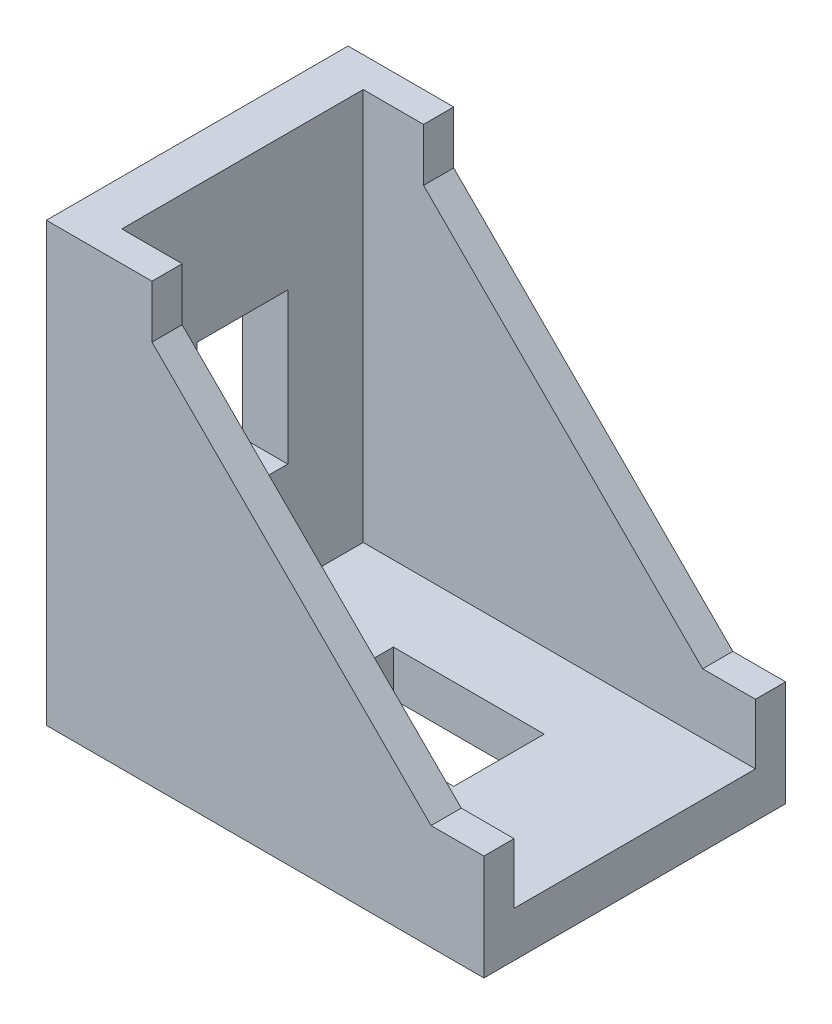
ISO-10303-21;
HEADER;
FILE_DESCRIPTION(('STEP AP214'),'2;1');
FILE_NAME('part.step','',(''),(''),'','','');
FILE_SCHEMA(('AUTOMOTIVE_DESIGN { 1 0 10303 214 1 1 1 1 }'));
ENDSEC;
DATA;
#1=APPLICATION_CONTEXT('core data for automotive mechanical design processes');
#2=APPLICATION_PROTOCOL_DEFINITION('international standard','automotive_design',2000,#1);
#3=PRODUCT_CONTEXT('',#1,'mechanical');
#4=PRODUCT('Part','Part','',(#3));
#5=PRODUCT_RELATED_PRODUCT_CATEGORY('part','',(#4));
#6=PRODUCT_DEFINITION_FORMATION('','',#4);
#7=PRODUCT_DEFINITION_CONTEXT('part definition',#1,'design');
#8=PRODUCT_DEFINITION('design','',#6,#7);
#9=PRODUCT_DEFINITION_SHAPE('','',#8);
#10=(LENGTH_UNIT() NAMED_UNIT(*) SI_UNIT(.MILLI.,.METRE.));
#11=(NAMED_UNIT(*) PLANE_ANGLE_UNIT() SI_UNIT($,.RADIAN.));
#12=(NAMED_UNIT(*) SI_UNIT($,.STERADIAN.) SOLID_ANGLE_UNIT());
#13=UNCERTAINTY_MEASURE_WITH_UNIT(LENGTH_MEASURE(1.E-05),#10,'distance_accuracy_value','');
#14=(GEOMETRIC_REPRESENTATION_CONTEXT(3) GLOBAL_UNCERTAINTY_ASSIGNED_CONTEXT((#13)) GLOBAL_UNIT_ASSIGNED_CONTEXT((#10,
#11,#12)) REPRESENTATION_CONTEXT('',''));
#15=CARTESIAN_POINT('',(0.,0.,0.));
#16=DIRECTION('',(0.,0.,1.));
#17=DIRECTION('',(1.,0.,0.));
#18=AXIS2_PLACEMENT_3D('',#15,#16,#17);
#19=CARTESIAN_POINT('',(14.5,-14.5,20.));
#20=DIRECTION('',(-1.,0.,0.));
#21=DIRECTION('',(0.,0.,1.));
#22=AXIS2_PLACEMENT_3D('',#19,#20,#21);
#23=PLANE('',#22);
#24=DIRECTION('',(0.,1.,0.));
#25=VECTOR('',#24,1.);
#26=CARTESIAN_POINT('',(14.5,-14.5,0.));
#27=LINE('',#26,#25);
#28=CARTESIAN_POINT('',(14.5,-14.5,0.));
#29=VERTEX_POINT('',#28);
#30=CARTESIAN_POINT('',(14.5,-7.5,0.));
#31=VERTEX_POINT('',#30);
#32=EDGE_CURVE('E298',#29,#31,#27,.T.);
#33=ORIENTED_EDGE('',*,*,#32,.T.);
#34=DIRECTION('',(0.,0.,1.));
#35=VECTOR('',#34,1.);
#36=CARTESIAN_POINT('',(14.5,-7.5,0.));
#37=LINE('',#36,#35);
#38=CARTESIAN_POINT('',(14.5,-7.5,2.));
#39=VERTEX_POINT('',#38);
#40=EDGE_CURVE('E251',#31,#39,#37,.T.);
#41=ORIENTED_EDGE('',*,*,#40,.T.);
#42=DIRECTION('',(0.,1.,0.));
#43=VECTOR('',#42,1.);
#44=CARTESIAN_POINT('',(14.5,-11.5,2.));
#45=LINE('',#44,#43);
#46=CARTESIAN_POINT('',(14.5,-11.5,2.));
#47=VERTEX_POINT('',#46);
#48=EDGE_CURVE('E288',#47,#39,#45,.T.);
#49=ORIENTED_EDGE('',*,*,#48,.F.);
#50=DIRECTION('',(0.,0.,-1.));
#51=VECTOR('',#50,1.);
#52=CARTESIAN_POINT('',(14.5,-11.5,18.));
#53=LINE('',#52,#51);
#54=CARTESIAN_POINT('',(14.5,-11.5,18.));
#55=VERTEX_POINT('',#54);
#56=EDGE_CURVE('E275',#55,#47,#53,.T.);
#57=ORIENTED_EDGE('',*,*,#56,.F.);
#58=DIRECTION('',(0.,1.,0.));
#59=VECTOR('',#58,1.);
#60=CARTESIAN_POINT('',(14.5,-11.5,18.));
#61=LINE('',#60,#59);
#62=CARTESIAN_POINT('',(14.5,-7.5,18.));
#63=VERTEX_POINT('',#62);
#64=EDGE_CURVE('E295',#55,#63,#61,.T.);
#65=ORIENTED_EDGE('',*,*,#64,.T.);
#66=CARTESIAN_POINT('',(14.5,-7.5,20.));
#67=VERTEX_POINT('',#66);
#68=EDGE_CURVE('E255',#63,#67,#37,.T.);
#69=ORIENTED_EDGE('',*,*,#68,.T.);
#70=DIRECTION('',(0.,1.,0.));
#71=VECTOR('',#70,1.);
#72=CARTESIAN_POINT('',(14.5,-14.5,20.));
#73=LINE('',#72,#71);
#74=CARTESIAN_POINT('',(14.5,-14.5,20.));
#75=VERTEX_POINT('',#74);
#76=EDGE_CURVE('E306',#75,#67,#73,.T.);
#77=ORIENTED_EDGE('',*,*,#76,.F.);
#78=DIRECTION('',(0.,0.,-1.));
#79=VECTOR('',#78,1.);
#80=CARTESIAN_POINT('',(14.5,-14.5,20.));
#81=LINE('',#80,#79);
#82=EDGE_CURVE('E316',#75,#29,#81,.T.);
#83=ORIENTED_EDGE('',*,*,#82,.T.);
#84=EDGE_LOOP('',(#33,#41,#49,#57,#65,#69,#77,#83));
#85=FACE_BOUND('',#84,.T.);
#86=ADVANCED_FACE('F37',(#85),#23,.F.);
#87=CARTESIAN_POINT('',(-14.5,14.5,20.));
#88=DIRECTION('',(0.,-1.,0.));
#89=DIRECTION('',(0.,0.,-1.));
#90=AXIS2_PLACEMENT_3D('',#87,#88,#89);
#91=PLANE('',#90);
#92=DIRECTION('',(-1.,0.,0.));
#93=VECTOR('',#92,1.);
#94=CARTESIAN_POINT('',(-14.5,14.5,20.));
#95=LINE('',#94,#93);
#96=CARTESIAN_POINT('',(-7.5,14.5,20.));
#97=VERTEX_POINT('',#96);
#98=CARTESIAN_POINT('',(-14.5,14.5,20.));
#99=VERTEX_POINT('',#98);
#100=EDGE_CURVE('E309',#97,#99,#95,.T.);
#101=ORIENTED_EDGE('',*,*,#100,.F.);
#102=DIRECTION('',(0.,0.,1.));
#103=VECTOR('',#102,1.);
#104=CARTESIAN_POINT('',(-7.5,14.5,0.));
#105=LINE('',#104,#103);
#106=CARTESIAN_POINT('',(-7.5,14.5,18.));
#107=VERTEX_POINT('',#106);
#108=EDGE_CURVE('E244',#107,#97,#105,.T.);
#109=ORIENTED_EDGE('',*,*,#108,.F.);
#110=DIRECTION('',(1.,0.,0.));
#111=VECTOR('',#110,1.);
#112=CARTESIAN_POINT('',(-11.5,14.5,18.));
#113=LINE('',#112,#111);
#114=CARTESIAN_POINT('',(-11.5,14.5,18.));
#115=VERTEX_POINT('',#114);
#116=EDGE_CURVE('E279',#115,#107,#113,.T.);
#117=ORIENTED_EDGE('',*,*,#116,.F.);
#118=DIRECTION('',(0.,0.,1.));
#119=VECTOR('',#118,1.);
#120=CARTESIAN_POINT('',(-11.5,14.5,18.));
#121=LINE('',#120,#119);
#122=CARTESIAN_POINT('',(-11.5,14.5,2.));
#123=VERTEX_POINT('',#122);
#124=EDGE_CURVE('E290',#123,#115,#121,.T.);
#125=ORIENTED_EDGE('',*,*,#124,.F.);
#126=DIRECTION('',(-1.,0.,0.));
#127=VECTOR('',#126,1.);
#128=CARTESIAN_POINT('',(-11.5,14.5,2.));
#129=LINE('',#128,#127);
#130=CARTESIAN_POINT('',(-7.5,14.5,2.));
#131=VERTEX_POINT('',#130);
#132=EDGE_CURVE('E274',#131,#123,#129,.T.);
#133=ORIENTED_EDGE('',*,*,#132,.F.);
#134=CARTESIAN_POINT('',(-7.5,14.5,0.));
#135=VERTEX_POINT('',#134);
#136=EDGE_CURVE('E264',#135,#131,#105,.T.);
#137=ORIENTED_EDGE('',*,*,#136,.F.);
#138=DIRECTION('',(-1.,0.,0.));
#139=VECTOR('',#138,1.);
#140=CARTESIAN_POINT('',(-14.5,14.5,0.));
#141=LINE('',#140,#139);
#142=CARTESIAN_POINT('',(-14.5,14.5,0.));
#143=VERTEX_POINT('',#142);
#144=EDGE_CURVE('E319',#135,#143,#141,.T.);
#145=ORIENTED_EDGE('',*,*,#144,.T.);
#146=DIRECTION('',(0.,0.,-1.));
#147=VECTOR('',#146,1.);
#148=CARTESIAN_POINT('',(-14.5,14.5,20.));
#149=LINE('',#148,#147);
#150=EDGE_CURVE('E329',#99,#143,#149,.T.);
#151=ORIENTED_EDGE('',*,*,#150,.F.);
#152=EDGE_LOOP('',(#101,#109,#117,#125,#133,#137,#145,#151));
#153=FACE_BOUND('',#152,.T.);
#154=ADVANCED_FACE('F377',(#153),#91,.F.);
#155=CARTESIAN_POINT('',(-14.5,-14.5,20.));
#156=DIRECTION('',(1.,0.,0.));
#157=DIRECTION('',(0.,0.,-1.));
#158=AXIS2_PLACEMENT_3D('',#155,#156,#157);
#159=PLANE('',#158);
#160=DIRECTION('',(0.,0.,-1.));
#161=VECTOR('',#160,1.);
#162=CARTESIAN_POINT('',(-14.5,5.50000000000001,7.));
#163=LINE('',#162,#161);
#164=CARTESIAN_POINT('',(-14.5,5.50000000000001,13.));
#165=VERTEX_POINT('',#164);
#166=CARTESIAN_POINT('',(-14.5,5.50000000000001,7.));
#167=VERTEX_POINT('',#166);
#168=EDGE_CURVE('E197',#165,#167,#163,.T.);
#169=ORIENTED_EDGE('',*,*,#168,.F.);
#170=DIRECTION('',(0.,1.,0.));
#171=VECTOR('',#170,1.);
#172=CARTESIAN_POINT('',(-14.5,5.50000000000001,13.));
#173=LINE('',#172,#171);
#174=CARTESIAN_POINT('',(-14.5,-4.49999999999999,13.));
#175=VERTEX_POINT('',#174);
#176=EDGE_CURVE('E51',#175,#165,#173,.T.);
#177=ORIENTED_EDGE('',*,*,#176,.F.);
#178=DIRECTION('',(0.,0.,1.));
#179=VECTOR('',#178,1.);
#180=CARTESIAN_POINT('',(-14.5,-4.49999999999999,7.));
#181=LINE('',#180,#179);
#182=CARTESIAN_POINT('',(-14.5,-4.49999999999999,7.));
#183=VERTEX_POINT('',#182);
#184=EDGE_CURVE('E204',#183,#175,#181,.T.);
#185=ORIENTED_EDGE('',*,*,#184,.F.);
#186=DIRECTION('',(0.,-1.,0.));
#187=VECTOR('',#186,1.);
#188=CARTESIAN_POINT('',(-14.5,5.50000000000001,7.));
#189=LINE('',#188,#187);
#190=EDGE_CURVE('E188',#167,#183,#189,.T.);
#191=ORIENTED_EDGE('',*,*,#190,.F.);
#192=EDGE_LOOP('',(#169,#177,#185,#191));
#193=FACE_BOUND('',#192,.T.);
#194=DIRECTION('',(0.,-1.,0.));
#195=VECTOR('',#194,1.);
#196=CARTESIAN_POINT('',(-14.5,-14.5,0.));
#197=LINE('',#196,#195);
#198=CARTESIAN_POINT('',(-14.5,-14.5,0.));
#199=VERTEX_POINT('',#198);
#200=EDGE_CURVE('E321',#143,#199,#197,.T.);
#201=ORIENTED_EDGE('',*,*,#200,.T.);
#202=DIRECTION('',(0.,0.,-1.));
#203=VECTOR('',#202,1.);
#204=CARTESIAN_POINT('',(-14.5,-14.5,20.));
#205=LINE('',#204,#203);
#206=CARTESIAN_POINT('',(-14.5,-14.5,20.));
#207=VERTEX_POINT('',#206);
#208=EDGE_CURVE('E326',#207,#199,#205,.T.);
#209=ORIENTED_EDGE('',*,*,#208,.F.);
#210=DIRECTION('',(0.,-1.,0.));
#211=VECTOR('',#210,1.);
#212=CARTESIAN_POINT('',(-14.5,-14.5,20.));
#213=LINE('',#212,#211);
#214=EDGE_CURVE('E312',#99,#207,#213,.T.);
#215=ORIENTED_EDGE('',*,*,#214,.F.);
#216=ORIENTED_EDGE('',*,*,#150,.T.);
#217=EDGE_LOOP('',(#201,#209,#215,#216));
#218=FACE_BOUND('',#217,.T.);
#219=ADVANCED_FACE('F201',(#193,#218),#159,.F.);
#220=CARTESIAN_POINT('',(-14.5,-14.5,20.));
#221=DIRECTION('',(0.,1.,0.));
#222=DIRECTION('',(0.,0.,1.));
#223=AXIS2_PLACEMENT_3D('',#220,#221,#222);
#224=PLANE('',#223);
#225=DIRECTION('',(-1.,0.,0.));
#226=VECTOR('',#225,1.);
#227=CARTESIAN_POINT('',(-4.5,-14.5,13.));
#228=LINE('',#227,#226);
#229=CARTESIAN_POINT('',(5.5,-14.5,13.));
#230=VERTEX_POINT('',#229);
#231=CARTESIAN_POINT('',(-4.5,-14.5,13.));
#232=VERTEX_POINT('',#231);
#233=EDGE_CURVE('E215',#230,#232,#228,.T.);
#234=ORIENTED_EDGE('',*,*,#233,.F.);
#235=DIRECTION('',(0.,0.,1.));
#236=VECTOR('',#235,1.);
#237=CARTESIAN_POINT('',(5.5,-14.5,13.));
#238=LINE('',#237,#236);
#239=CARTESIAN_POINT('',(5.5,-14.5,7.));
#240=VERTEX_POINT('',#239);
#241=EDGE_CURVE('E211',#240,#230,#238,.T.);
#242=ORIENTED_EDGE('',*,*,#241,.F.);
#243=DIRECTION('',(1.,0.,0.));
#244=VECTOR('',#243,1.);
#245=CARTESIAN_POINT('',(-4.5,-14.5,7.));
#246=LINE('',#245,#244);
#247=CARTESIAN_POINT('',(-4.5,-14.5,7.));
#248=VERTEX_POINT('',#247);
#249=EDGE_CURVE('E221',#248,#240,#246,.T.);
#250=ORIENTED_EDGE('',*,*,#249,.F.);
#251=DIRECTION('',(0.,0.,-1.));
#252=VECTOR('',#251,1.);
#253=CARTESIAN_POINT('',(-4.5,-14.5,13.));
#254=LINE('',#253,#252);
#255=EDGE_CURVE('E218',#232,#248,#254,.T.);
#256=ORIENTED_EDGE('',*,*,#255,.F.);
#257=EDGE_LOOP('',(#234,#242,#250,#256));
#258=FACE_BOUND('',#257,.T.);
#259=DIRECTION('',(1.,0.,0.));
#260=VECTOR('',#259,1.);
#261=CARTESIAN_POINT('',(-14.5,-14.5,0.));
#262=LINE('',#261,#260);
#263=EDGE_CURVE('E310',#199,#29,#262,.T.);
#264=ORIENTED_EDGE('',*,*,#263,.T.);
#265=ORIENTED_EDGE('',*,*,#82,.F.);
#266=DIRECTION('',(1.,0.,0.));
#267=VECTOR('',#266,1.);
#268=CARTESIAN_POINT('',(-14.5,-14.5,20.));
#269=LINE('',#268,#267);
#270=EDGE_CURVE('E314',#207,#75,#269,.T.);
#271=ORIENTED_EDGE('',*,*,#270,.F.);
#272=ORIENTED_EDGE('',*,*,#208,.T.);
#273=EDGE_LOOP('',(#264,#265,#271,#272));
#274=FACE_BOUND('',#273,.T.);
#275=ADVANCED_FACE('F420',(#258,#274),#224,.F.);
#276=CARTESIAN_POINT('',(0.,0.,20.));
#277=DIRECTION('',(0.,0.,-1.));
#278=DIRECTION('',(-1.,0.,0.));
#279=AXIS2_PLACEMENT_3D('',#276,#277,#278);
#280=PLANE('',#279);
#281=ORIENTED_EDGE('',*,*,#76,.T.);
#282=DIRECTION('',(1.,0.,0.));
#283=VECTOR('',#282,1.);
#284=CARTESIAN_POINT('',(11.,-7.5,20.));
#285=LINE('',#284,#283);
#286=CARTESIAN_POINT('',(11.,-7.5,20.));
#287=VERTEX_POINT('',#286);
#288=EDGE_CURVE('E238',#287,#67,#285,.T.);
#289=ORIENTED_EDGE('',*,*,#288,.F.);
#290=DIRECTION('',(0.707106781186548,-0.707106781186548,0.));
#291=VECTOR('',#290,1.);
#292=CARTESIAN_POINT('',(-7.5,11.,20.));
#293=LINE('',#292,#291);
#294=CARTESIAN_POINT('',(-7.5,11.,20.));
#295=VERTEX_POINT('',#294);
#296=EDGE_CURVE('E247',#295,#287,#293,.T.);
#297=ORIENTED_EDGE('',*,*,#296,.F.);
#298=DIRECTION('',(0.,-1.,0.));
#299=VECTOR('',#298,1.);
#300=CARTESIAN_POINT('',(-7.5,14.5,20.));
#301=LINE('',#300,#299);
#302=EDGE_CURVE('E227',#97,#295,#301,.T.);
#303=ORIENTED_EDGE('',*,*,#302,.F.);
#304=ORIENTED_EDGE('',*,*,#100,.T.);
#305=ORIENTED_EDGE('',*,*,#214,.T.);
#306=ORIENTED_EDGE('',*,*,#270,.T.);
#307=EDGE_LOOP('',(#281,#289,#297,#303,#304,#305,#306));
#308=FACE_BOUND('',#307,.T.);
#309=ADVANCED_FACE('F415',(#308),#280,.F.);
#310=CARTESIAN_POINT('',(0.,0.,0.));
#311=DIRECTION('',(0.,0.,-1.));
#312=DIRECTION('',(-1.,0.,0.));
#313=AXIS2_PLACEMENT_3D('',#310,#311,#312);
#314=PLANE('',#313);
#315=DIRECTION('',(1.,0.,0.));
#316=VECTOR('',#315,1.);
#317=CARTESIAN_POINT('',(11.,-7.5,0.));
#318=LINE('',#317,#316);
#319=CARTESIAN_POINT('',(11.,-7.5,0.));
#320=VERTEX_POINT('',#319);
#321=EDGE_CURVE('E241',#320,#31,#318,.T.);
#322=ORIENTED_EDGE('',*,*,#321,.T.);
#323=ORIENTED_EDGE('',*,*,#32,.F.);
#324=ORIENTED_EDGE('',*,*,#263,.F.);
#325=ORIENTED_EDGE('',*,*,#200,.F.);
#326=ORIENTED_EDGE('',*,*,#144,.F.);
#327=DIRECTION('',(0.,-1.,0.));
#328=VECTOR('',#327,1.);
#329=CARTESIAN_POINT('',(-7.5,14.5,0.));
#330=LINE('',#329,#328);
#331=CARTESIAN_POINT('',(-7.5,11.,0.));
#332=VERTEX_POINT('',#331);
#333=EDGE_CURVE('E234',#135,#332,#330,.T.);
#334=ORIENTED_EDGE('',*,*,#333,.T.);
#335=DIRECTION('',(0.707106781186548,-0.707106781186548,0.));
#336=VECTOR('',#335,1.);
#337=CARTESIAN_POINT('',(-7.5,11.,0.));
#338=LINE('',#337,#336);
#339=EDGE_CURVE('E237',#332,#320,#338,.T.);
#340=ORIENTED_EDGE('',*,*,#339,.T.);
#341=EDGE_LOOP('',(#322,#323,#324,#325,#326,#334,#340));
#342=FACE_BOUND('',#341,.T.);
#343=ADVANCED_FACE('F389',(#342),#314,.T.);
#344=CARTESIAN_POINT('',(-11.5,-11.5,18.));
#345=DIRECTION('',(0.,0.,1.));
#346=DIRECTION('',(1.,0.,0.));
#347=AXIS2_PLACEMENT_3D('',#344,#345,#346);
#348=PLANE('',#347);
#349=DIRECTION('',(0.707106781186548,-0.707106781186548,0.));
#350=VECTOR('',#349,1.);
#351=CARTESIAN_POINT('',(1.75,1.75,18.));
#352=LINE('',#351,#350);
#353=CARTESIAN_POINT('',(-7.5,11.,18.));
#354=VERTEX_POINT('',#353);
#355=CARTESIAN_POINT('',(11.,-7.5,18.));
#356=VERTEX_POINT('',#355);
#357=EDGE_CURVE('E268',#354,#356,#352,.T.);
#358=ORIENTED_EDGE('',*,*,#357,.T.);
#359=DIRECTION('',(1.,0.,0.));
#360=VECTOR('',#359,1.);
#361=CARTESIAN_POINT('',(-11.5,-7.5,18.));
#362=LINE('',#361,#360);
#363=EDGE_CURVE('E271',#356,#63,#362,.T.);
#364=ORIENTED_EDGE('',*,*,#363,.T.);
#365=ORIENTED_EDGE('',*,*,#64,.F.);
#366=DIRECTION('',(1.,0.,0.));
#367=VECTOR('',#366,1.);
#368=CARTESIAN_POINT('',(-11.5,-11.5,18.));
#369=LINE('',#368,#367);
#370=CARTESIAN_POINT('',(-11.5,-11.5,18.));
#371=VERTEX_POINT('',#370);
#372=EDGE_CURVE('E285',#371,#55,#369,.T.);
#373=ORIENTED_EDGE('',*,*,#372,.F.);
#374=DIRECTION('',(0.,1.,0.));
#375=VECTOR('',#374,1.);
#376=CARTESIAN_POINT('',(-11.5,-11.5,18.));
#377=LINE('',#376,#375);
#378=EDGE_CURVE('E299',#371,#115,#377,.T.);
#379=ORIENTED_EDGE('',*,*,#378,.T.);
#380=ORIENTED_EDGE('',*,*,#116,.T.);
#381=DIRECTION('',(0.,-1.,0.));
#382=VECTOR('',#381,1.);
#383=CARTESIAN_POINT('',(-7.49999999999999,-11.5,18.));
#384=LINE('',#383,#382);
#385=EDGE_CURVE('E254',#107,#354,#384,.T.);
#386=ORIENTED_EDGE('',*,*,#385,.T.);
#387=EDGE_LOOP('',(#358,#364,#365,#373,#379,#380,#386));
#388=FACE_BOUND('',#387,.T.);
#389=ADVANCED_FACE('F404',(#388),#348,.F.);
#390=CARTESIAN_POINT('',(-11.5,-11.5,18.));
#391=DIRECTION('',(-1.,0.,0.));
#392=DIRECTION('',(0.,0.,1.));
#393=AXIS2_PLACEMENT_3D('',#390,#391,#392);
#394=PLANE('',#393);
#395=DIRECTION('',(0.,0.,1.));
#396=VECTOR('',#395,1.);
#397=CARTESIAN_POINT('',(-11.5,-4.49999999999999,18.));
#398=LINE('',#397,#396);
#399=CARTESIAN_POINT('',(-11.5,-4.49999999999999,7.));
#400=VERTEX_POINT('',#399);
#401=CARTESIAN_POINT('',(-11.5,-4.49999999999999,13.));
#402=VERTEX_POINT('',#401);
#403=EDGE_CURVE('E44',#400,#402,#398,.T.);
#404=ORIENTED_EDGE('',*,*,#403,.T.);
#405=DIRECTION('',(0.,1.,0.));
#406=VECTOR('',#405,1.);
#407=CARTESIAN_POINT('',(-11.5,-11.5,13.));
#408=LINE('',#407,#406);
#409=CARTESIAN_POINT('',(-11.5,5.50000000000001,13.));
#410=VERTEX_POINT('',#409);
#411=EDGE_CURVE('E11',#402,#410,#408,.T.);
#412=ORIENTED_EDGE('',*,*,#411,.T.);
#413=DIRECTION('',(0.,0.,-1.));
#414=VECTOR('',#413,1.);
#415=CARTESIAN_POINT('',(-11.5,5.5,18.));
#416=LINE('',#415,#414);
#417=CARTESIAN_POINT('',(-11.5,5.5,7.));
#418=VERTEX_POINT('',#417);
#419=EDGE_CURVE('E353',#410,#418,#416,.T.);
#420=ORIENTED_EDGE('',*,*,#419,.T.);
#421=DIRECTION('',(0.,-1.,0.));
#422=VECTOR('',#421,1.);
#423=CARTESIAN_POINT('',(-11.5,-11.5,7.00000000000001));
#424=LINE('',#423,#422);
#425=EDGE_CURVE('E191',#418,#400,#424,.T.);
#426=ORIENTED_EDGE('',*,*,#425,.T.);
#427=EDGE_LOOP('',(#404,#412,#420,#426));
#428=FACE_BOUND('',#427,.T.);
#429=ORIENTED_EDGE('',*,*,#124,.T.);
#430=ORIENTED_EDGE('',*,*,#378,.F.);
#431=DIRECTION('',(0.,0.,1.));
#432=VECTOR('',#431,1.);
#433=CARTESIAN_POINT('',(-11.5,-11.5,18.));
#434=LINE('',#433,#432);
#435=CARTESIAN_POINT('',(-11.5,-11.5,2.));
#436=VERTEX_POINT('',#435);
#437=EDGE_CURVE('E282',#436,#371,#434,.T.);
#438=ORIENTED_EDGE('',*,*,#437,.F.);
#439=DIRECTION('',(0.,1.,0.));
#440=VECTOR('',#439,1.);
#441=CARTESIAN_POINT('',(-11.5,-11.5,2.));
#442=LINE('',#441,#440);
#443=EDGE_CURVE('E301',#436,#123,#442,.T.);
#444=ORIENTED_EDGE('',*,*,#443,.T.);
#445=EDGE_LOOP('',(#429,#430,#438,#444));
#446=FACE_BOUND('',#445,.T.);
#447=ADVANCED_FACE('F357',(#428,#446),#394,.F.);
#448=CARTESIAN_POINT('',(-11.5,-11.5,2.));
#449=DIRECTION('',(0.,0.,-1.));
#450=DIRECTION('',(-1.,0.,0.));
#451=AXIS2_PLACEMENT_3D('',#448,#449,#450);
#452=PLANE('',#451);
#453=ORIENTED_EDGE('',*,*,#48,.T.);
#454=DIRECTION('',(-1.,0.,0.));
#455=VECTOR('',#454,1.);
#456=CARTESIAN_POINT('',(-11.5,-7.5,2.));
#457=LINE('',#456,#455);
#458=CARTESIAN_POINT('',(11.,-7.5,2.));
#459=VERTEX_POINT('',#458);
#460=EDGE_CURVE('E338',#39,#459,#457,.T.);
#461=ORIENTED_EDGE('',*,*,#460,.T.);
#462=DIRECTION('',(-0.707106781186548,0.707106781186548,0.));
#463=VECTOR('',#462,1.);
#464=CARTESIAN_POINT('',(1.75,1.75,2.));
#465=LINE('',#464,#463);
#466=CARTESIAN_POINT('',(-7.5,11.,2.));
#467=VERTEX_POINT('',#466);
#468=EDGE_CURVE('E335',#459,#467,#465,.T.);
#469=ORIENTED_EDGE('',*,*,#468,.T.);
#470=DIRECTION('',(0.,1.,0.));
#471=VECTOR('',#470,1.);
#472=CARTESIAN_POINT('',(-7.49999999999999,-11.5,2.));
#473=LINE('',#472,#471);
#474=EDGE_CURVE('E332',#467,#131,#473,.T.);
#475=ORIENTED_EDGE('',*,*,#474,.T.);
#476=ORIENTED_EDGE('',*,*,#132,.T.);
#477=ORIENTED_EDGE('',*,*,#443,.F.);
#478=DIRECTION('',(-1.,0.,0.));
#479=VECTOR('',#478,1.);
#480=CARTESIAN_POINT('',(-11.5,-11.5,2.));
#481=LINE('',#480,#479);
#482=EDGE_CURVE('E278',#47,#436,#481,.T.);
#483=ORIENTED_EDGE('',*,*,#482,.F.);
#484=EDGE_LOOP('',(#453,#461,#469,#475,#476,#477,#483));
#485=FACE_BOUND('',#484,.T.);
#486=ADVANCED_FACE('F396',(#485),#452,.F.);
#487=CARTESIAN_POINT('',(0.,-11.5,0.));
#488=DIRECTION('',(0.,-1.,0.));
#489=DIRECTION('',(0.,0.,-1.));
#490=AXIS2_PLACEMENT_3D('',#487,#488,#489);
#491=PLANE('',#490);
#492=DIRECTION('',(1.,0.,0.));
#493=VECTOR('',#492,1.);
#494=CARTESIAN_POINT('',(0.,-11.5,7.));
#495=LINE('',#494,#493);
#496=CARTESIAN_POINT('',(-4.5,-11.5,7.));
#497=VERTEX_POINT('',#496);
#498=CARTESIAN_POINT('',(5.5,-11.5,7.));
#499=VERTEX_POINT('',#498);
#500=EDGE_CURVE('E347',#497,#499,#495,.T.);
#501=ORIENTED_EDGE('',*,*,#500,.T.);
#502=DIRECTION('',(0.,0.,1.));
#503=VECTOR('',#502,1.);
#504=CARTESIAN_POINT('',(5.5,-11.5,0.));
#505=LINE('',#504,#503);
#506=CARTESIAN_POINT('',(5.5,-11.5,13.));
#507=VERTEX_POINT('',#506);
#508=EDGE_CURVE('E350',#499,#507,#505,.T.);
#509=ORIENTED_EDGE('',*,*,#508,.T.);
#510=DIRECTION('',(-1.,0.,0.));
#511=VECTOR('',#510,1.);
#512=CARTESIAN_POINT('',(0.,-11.5,13.));
#513=LINE('',#512,#511);
#514=CARTESIAN_POINT('',(-4.5,-11.5,13.));
#515=VERTEX_POINT('',#514);
#516=EDGE_CURVE('E341',#507,#515,#513,.T.);
#517=ORIENTED_EDGE('',*,*,#516,.T.);
#518=DIRECTION('',(0.,0.,-1.));
#519=VECTOR('',#518,1.);
#520=CARTESIAN_POINT('',(-4.5,-11.5,0.));
#521=LINE('',#520,#519);
#522=EDGE_CURVE('E344',#515,#497,#521,.T.);
#523=ORIENTED_EDGE('',*,*,#522,.T.);
#524=EDGE_LOOP('',(#501,#509,#517,#523));
#525=FACE_BOUND('',#524,.T.);
#526=ORIENTED_EDGE('',*,*,#56,.T.);
#527=ORIENTED_EDGE('',*,*,#482,.T.);
#528=ORIENTED_EDGE('',*,*,#437,.T.);
#529=ORIENTED_EDGE('',*,*,#372,.T.);
#530=EDGE_LOOP('',(#526,#527,#528,#529));
#531=FACE_BOUND('',#530,.T.);
#532=ADVANCED_FACE('F400',(#525,#531),#491,.F.);
#533=CARTESIAN_POINT('',(-7.5,14.5,0.));
#534=DIRECTION('',(-1.,0.,0.));
#535=DIRECTION('',(0.,-1.,0.));
#536=AXIS2_PLACEMENT_3D('',#533,#534,#535);
#537=PLANE('',#536);
#538=DIRECTION('',(0.,0.,1.));
#539=VECTOR('',#538,1.);
#540=CARTESIAN_POINT('',(-7.5,11.,0.));
#541=LINE('',#540,#539);
#542=EDGE_CURVE('E260',#332,#467,#541,.T.);
#543=ORIENTED_EDGE('',*,*,#542,.F.);
#544=ORIENTED_EDGE('',*,*,#333,.F.);
#545=ORIENTED_EDGE('',*,*,#136,.T.);
#546=ORIENTED_EDGE('',*,*,#474,.F.);
#547=EDGE_LOOP('',(#543,#544,#545,#546));
#548=FACE_BOUND('',#547,.T.);
#549=ADVANCED_FACE('F428',(#548),#537,.F.);
#550=CARTESIAN_POINT('',(-7.5,11.,0.));
#551=DIRECTION('',(-0.707106781186548,-0.707106781186548,0.));
#552=DIRECTION('',(0.707106781186548,-0.707106781186548,0.));
#553=AXIS2_PLACEMENT_3D('',#550,#551,#552);
#554=PLANE('',#553);
#555=DIRECTION('',(0.,0.,1.));
#556=VECTOR('',#555,1.);
#557=CARTESIAN_POINT('',(11.,-7.5,0.));
#558=LINE('',#557,#556);
#559=EDGE_CURVE('E256',#320,#459,#558,.T.);
#560=ORIENTED_EDGE('',*,*,#559,.F.);
#561=ORIENTED_EDGE('',*,*,#339,.F.);
#562=ORIENTED_EDGE('',*,*,#542,.T.);
#563=ORIENTED_EDGE('',*,*,#468,.F.);
#564=EDGE_LOOP('',(#560,#561,#562,#563));
#565=FACE_BOUND('',#564,.T.);
#566=ADVANCED_FACE('F444',(#565),#554,.F.);
#567=CARTESIAN_POINT('',(11.,-7.5,0.));
#568=DIRECTION('',(0.,-1.,0.));
#569=DIRECTION('',(0.,0.,-1.));
#570=AXIS2_PLACEMENT_3D('',#567,#568,#569);
#571=PLANE('',#570);
#572=ORIENTED_EDGE('',*,*,#40,.F.);
#573=ORIENTED_EDGE('',*,*,#321,.F.);
#574=ORIENTED_EDGE('',*,*,#559,.T.);
#575=ORIENTED_EDGE('',*,*,#460,.F.);
#576=EDGE_LOOP('',(#572,#573,#574,#575));
#577=FACE_BOUND('',#576,.T.);
#578=ADVANCED_FACE('F394',(#577),#571,.F.);
#579=EDGE_CURVE('E259',#356,#287,#558,.T.);
#580=ORIENTED_EDGE('',*,*,#579,.T.);
#581=ORIENTED_EDGE('',*,*,#288,.T.);
#582=ORIENTED_EDGE('',*,*,#68,.F.);
#583=ORIENTED_EDGE('',*,*,#363,.F.);
#584=EDGE_LOOP('',(#580,#581,#582,#583));
#585=FACE_BOUND('',#584,.T.);
#586=ADVANCED_FACE('F408',(#585),#571,.F.);
#587=EDGE_CURVE('E263',#354,#295,#541,.T.);
#588=ORIENTED_EDGE('',*,*,#587,.T.);
#589=ORIENTED_EDGE('',*,*,#296,.T.);
#590=ORIENTED_EDGE('',*,*,#579,.F.);
#591=ORIENTED_EDGE('',*,*,#357,.F.);
#592=EDGE_LOOP('',(#588,#589,#590,#591));
#593=FACE_BOUND('',#592,.T.);
#594=ADVANCED_FACE('F410',(#593),#554,.F.);
#595=ORIENTED_EDGE('',*,*,#108,.T.);
#596=ORIENTED_EDGE('',*,*,#302,.T.);
#597=ORIENTED_EDGE('',*,*,#587,.F.);
#598=ORIENTED_EDGE('',*,*,#385,.F.);
#599=EDGE_LOOP('',(#595,#596,#597,#598));
#600=FACE_BOUND('',#599,.T.);
#601=ADVANCED_FACE('F432',(#600),#537,.F.);
#602=CARTESIAN_POINT('',(5.5,14.5,13.));
#603=DIRECTION('',(1.,0.,0.));
#604=DIRECTION('',(0.,0.,-1.));
#605=AXIS2_PLACEMENT_3D('',#602,#603,#604);
#606=PLANE('',#605);
#607=DIRECTION('',(0.,-1.,0.));
#608=VECTOR('',#607,1.);
#609=CARTESIAN_POINT('',(5.5,14.5,7.));
#610=LINE('',#609,#608);
#611=EDGE_CURVE('E225',#499,#240,#610,.T.);
#612=ORIENTED_EDGE('',*,*,#611,.T.);
#613=ORIENTED_EDGE('',*,*,#241,.T.);
#614=DIRECTION('',(0.,-1.,0.));
#615=VECTOR('',#614,1.);
#616=CARTESIAN_POINT('',(5.5,14.5,13.));
#617=LINE('',#616,#615);
#618=EDGE_CURVE('E224',#507,#230,#617,.T.);
#619=ORIENTED_EDGE('',*,*,#618,.F.);
#620=ORIENTED_EDGE('',*,*,#508,.F.);
#621=EDGE_LOOP('',(#612,#613,#619,#620));
#622=FACE_BOUND('',#621,.T.);
#623=ADVANCED_FACE('F434',(#622),#606,.F.);
#624=CARTESIAN_POINT('',(-4.5,14.5,7.));
#625=DIRECTION('',(0.,0.,-1.));
#626=DIRECTION('',(-1.,0.,0.));
#627=AXIS2_PLACEMENT_3D('',#624,#625,#626);
#628=PLANE('',#627);
#629=DIRECTION('',(0.,-1.,0.));
#630=VECTOR('',#629,1.);
#631=CARTESIAN_POINT('',(-4.5,14.5,7.));
#632=LINE('',#631,#630);
#633=EDGE_CURVE('E228',#497,#248,#632,.T.);
#634=ORIENTED_EDGE('',*,*,#633,.T.);
#635=ORIENTED_EDGE('',*,*,#249,.T.);
#636=ORIENTED_EDGE('',*,*,#611,.F.);
#637=ORIENTED_EDGE('',*,*,#500,.F.);
#638=EDGE_LOOP('',(#634,#635,#636,#637));
#639=FACE_BOUND('',#638,.T.);
#640=ADVANCED_FACE('F440',(#639),#628,.F.);
#641=CARTESIAN_POINT('',(-4.5,14.5,13.));
#642=DIRECTION('',(-1.,0.,0.));
#643=DIRECTION('',(0.,0.,1.));
#644=AXIS2_PLACEMENT_3D('',#641,#642,#643);
#645=PLANE('',#644);
#646=DIRECTION('',(0.,-1.,0.));
#647=VECTOR('',#646,1.);
#648=CARTESIAN_POINT('',(-4.5,14.5,13.));
#649=LINE('',#648,#647);
#650=EDGE_CURVE('E230',#515,#232,#649,.T.);
#651=ORIENTED_EDGE('',*,*,#650,.T.);
#652=ORIENTED_EDGE('',*,*,#255,.T.);
#653=ORIENTED_EDGE('',*,*,#633,.F.);
#654=ORIENTED_EDGE('',*,*,#522,.F.);
#655=EDGE_LOOP('',(#651,#652,#653,#654));
#656=FACE_BOUND('',#655,.T.);
#657=ADVANCED_FACE('F371',(#656),#645,.F.);
#658=CARTESIAN_POINT('',(-4.5,14.5,13.));
#659=DIRECTION('',(0.,0.,1.));
#660=DIRECTION('',(1.,0.,0.));
#661=AXIS2_PLACEMENT_3D('',#658,#659,#660);
#662=PLANE('',#661);
#663=ORIENTED_EDGE('',*,*,#618,.T.);
#664=ORIENTED_EDGE('',*,*,#233,.T.);
#665=ORIENTED_EDGE('',*,*,#650,.F.);
#666=ORIENTED_EDGE('',*,*,#516,.F.);
#667=EDGE_LOOP('',(#663,#664,#665,#666));
#668=FACE_BOUND('',#667,.T.);
#669=ADVANCED_FACE('F364',(#668),#662,.F.);
#670=CARTESIAN_POINT('',(14.5,5.50000000000001,13.));
#671=DIRECTION('',(0.,0.,1.));
#672=DIRECTION('',(0.,-1.,0.));
#673=AXIS2_PLACEMENT_3D('',#670,#671,#672);
#674=PLANE('',#673);
#675=DIRECTION('',(-1.,0.,0.));
#676=VECTOR('',#675,1.);
#677=CARTESIAN_POINT('',(14.5,-4.49999999999999,13.));
#678=LINE('',#677,#676);
#679=EDGE_CURVE('E209',#402,#175,#678,.T.);
#680=ORIENTED_EDGE('',*,*,#679,.T.);
#681=ORIENTED_EDGE('',*,*,#176,.T.);
#682=DIRECTION('',(-1.,0.,0.));
#683=VECTOR('',#682,1.);
#684=CARTESIAN_POINT('',(14.5,5.50000000000001,13.));
#685=LINE('',#684,#683);
#686=EDGE_CURVE('E194',#410,#165,#685,.T.);
#687=ORIENTED_EDGE('',*,*,#686,.F.);
#688=ORIENTED_EDGE('',*,*,#411,.F.);
#689=EDGE_LOOP('',(#680,#681,#687,#688));
#690=FACE_BOUND('',#689,.T.);
#691=ADVANCED_FACE('F362',(#690),#674,.F.);
#692=CARTESIAN_POINT('',(14.5,-4.49999999999999,7.));
#693=DIRECTION('',(0.,-1.,0.));
#694=DIRECTION('',(0.,0.,-1.));
#695=AXIS2_PLACEMENT_3D('',#692,#693,#694);
#696=PLANE('',#695);
#697=DIRECTION('',(-1.,0.,0.));
#698=VECTOR('',#697,1.);
#699=CARTESIAN_POINT('',(14.5,-4.49999999999999,7.));
#700=LINE('',#699,#698);
#701=EDGE_CURVE('E193',#400,#183,#700,.T.);
#702=ORIENTED_EDGE('',*,*,#701,.T.);
#703=ORIENTED_EDGE('',*,*,#184,.T.);
#704=ORIENTED_EDGE('',*,*,#679,.F.);
#705=ORIENTED_EDGE('',*,*,#403,.F.);
#706=EDGE_LOOP('',(#702,#703,#704,#705));
#707=FACE_BOUND('',#706,.T.);
#708=ADVANCED_FACE('F361',(#707),#696,.F.);
#709=CARTESIAN_POINT('',(14.5,5.50000000000001,7.));
#710=DIRECTION('',(0.,0.,-1.));
#711=DIRECTION('',(0.,1.,0.));
#712=AXIS2_PLACEMENT_3D('',#709,#710,#711);
#713=PLANE('',#712);
#714=DIRECTION('',(-1.,0.,0.));
#715=VECTOR('',#714,1.);
#716=CARTESIAN_POINT('',(14.5,5.50000000000001,7.));
#717=LINE('',#716,#715);
#718=EDGE_CURVE('E59',#418,#167,#717,.T.);
#719=ORIENTED_EDGE('',*,*,#718,.T.);
#720=ORIENTED_EDGE('',*,*,#190,.T.);
#721=ORIENTED_EDGE('',*,*,#701,.F.);
#722=ORIENTED_EDGE('',*,*,#425,.F.);
#723=EDGE_LOOP('',(#719,#720,#721,#722));
#724=FACE_BOUND('',#723,.T.);
#725=ADVANCED_FACE('F185',(#724),#713,.F.);
#726=CARTESIAN_POINT('',(14.5,5.50000000000001,7.));
#727=DIRECTION('',(0.,1.,0.));
#728=DIRECTION('',(0.,0.,1.));
#729=AXIS2_PLACEMENT_3D('',#726,#727,#728);
#730=PLANE('',#729);
#731=ORIENTED_EDGE('',*,*,#686,.T.);
#732=ORIENTED_EDGE('',*,*,#168,.T.);
#733=ORIENTED_EDGE('',*,*,#718,.F.);
#734=ORIENTED_EDGE('',*,*,#419,.F.);
#735=EDGE_LOOP('',(#731,#732,#733,#734));
#736=FACE_BOUND('',#735,.T.);
#737=ADVANCED_FACE('F198',(#736),#730,.F.);
#738=CLOSED_SHELL('',(#86,#154,#219,#275,#309,#343,#389,#447,#486,#532,#549,#566,#578,#586,#594,
#601,#623,#640,#657,#669,#691,#708,#725,#737));
#739=MANIFOLD_SOLID_BREP('B2',#738);
#740=ADVANCED_BREP_SHAPE_REPRESENTATION('',(#18,#739),#14);
#741=SHAPE_DEFINITION_REPRESENTATION(#9,#740);
ENDSEC;
END-ISO-10303-21;
